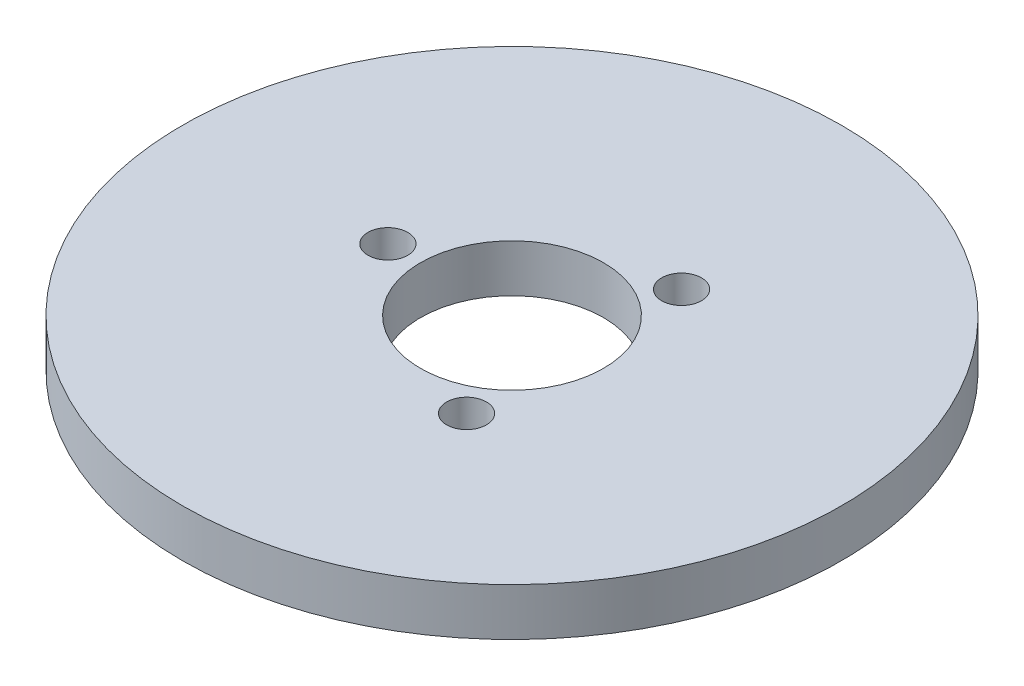
ISO-10303-21;
HEADER;
FILE_DESCRIPTION(('STEP AP214'),'2;1');
FILE_NAME('part.step','',(''),(''),'','','');
FILE_SCHEMA(('AUTOMOTIVE_DESIGN { 1 0 10303 214 1 1 1 1 }'));
ENDSEC;
DATA;
#1=APPLICATION_CONTEXT('core data for automotive mechanical design processes');
#2=APPLICATION_PROTOCOL_DEFINITION('international standard','automotive_design',2000,#1);
#3=PRODUCT_CONTEXT('',#1,'mechanical');
#4=PRODUCT('Part','Part','',(#3));
#5=PRODUCT_RELATED_PRODUCT_CATEGORY('part','',(#4));
#6=PRODUCT_DEFINITION_FORMATION('','',#4);
#7=PRODUCT_DEFINITION_CONTEXT('part definition',#1,'design');
#8=PRODUCT_DEFINITION('design','',#6,#7);
#9=PRODUCT_DEFINITION_SHAPE('','',#8);
#10=(LENGTH_UNIT() NAMED_UNIT(*) SI_UNIT(.MILLI.,.METRE.));
#11=(NAMED_UNIT(*) PLANE_ANGLE_UNIT() SI_UNIT($,.RADIAN.));
#12=(NAMED_UNIT(*) SI_UNIT($,.STERADIAN.) SOLID_ANGLE_UNIT());
#13=UNCERTAINTY_MEASURE_WITH_UNIT(LENGTH_MEASURE(1.E-05),#10,'distance_accuracy_value','');
#14=(GEOMETRIC_REPRESENTATION_CONTEXT(3) GLOBAL_UNCERTAINTY_ASSIGNED_CONTEXT((#13)) GLOBAL_UNIT_ASSIGNED_CONTEXT((#10,
#11,#12)) REPRESENTATION_CONTEXT('',''));
#15=CARTESIAN_POINT('',(0.,0.,0.));
#16=DIRECTION('',(0.,0.,1.));
#17=DIRECTION('',(1.,0.,0.));
#18=AXIS2_PLACEMENT_3D('',#15,#16,#17);
#19=CARTESIAN_POINT('',(0.,13.,0.));
#20=DIRECTION('',(0.,-1.,0.));
#21=DIRECTION('',(0.,0.,-1.));
#22=AXIS2_PLACEMENT_3D('',#19,#20,#21);
#23=CYLINDRICAL_SURFACE('',#22,90.);
#24=CARTESIAN_POINT('',(0.,13.,0.));
#25=DIRECTION('',(0.,1.,0.));
#26=DIRECTION('',(0.,0.,1.));
#27=AXIS2_PLACEMENT_3D('',#24,#25,#26);
#28=CIRCLE('',#27,90.);
#29=CARTESIAN_POINT('',(0.,13.,-90.));
#30=VERTEX_POINT('',#29);
#31=EDGE_CURVE('E10',#30,#30,#28,.T.);
#32=CARTESIAN_POINT('',(0.,0.,0.));
#33=DIRECTION('',(0.,1.,0.));
#34=DIRECTION('',(0.,0.,1.));
#35=AXIS2_PLACEMENT_3D('',#32,#33,#34);
#36=CIRCLE('',#35,90.);
#37=CARTESIAN_POINT('',(0.,0.,-90.));
#38=VERTEX_POINT('',#37);
#39=EDGE_CURVE('E37',#38,#38,#36,.T.);
#40=CARTESIAN_POINT('',(0.,13.,-90.));
#41=CARTESIAN_POINT('',(0.,12.8645833333333,-90.));
#42=CARTESIAN_POINT('',(0.,12.7291666666667,-90.));
#43=CARTESIAN_POINT('',(0.,12.4583333333333,-90.));
#44=CARTESIAN_POINT('',(0.,12.3229166666667,-90.));
#45=CARTESIAN_POINT('',(0.,12.0520833333333,-90.));
#46=CARTESIAN_POINT('',(0.,11.9166666666667,-90.));
#47=CARTESIAN_POINT('',(0.,11.6458333333333,-90.));
#48=CARTESIAN_POINT('',(0.,11.5104166666667,-90.));
#49=CARTESIAN_POINT('',(0.,11.2395833333333,-90.));
#50=CARTESIAN_POINT('',(0.,11.1041666666667,-90.));
#51=CARTESIAN_POINT('',(0.,10.8333333333333,-90.));
#52=CARTESIAN_POINT('',(0.,10.6979166666667,-90.));
#53=CARTESIAN_POINT('',(0.,10.4270833333333,-90.));
#54=CARTESIAN_POINT('',(0.,10.2916666666667,-90.));
#55=CARTESIAN_POINT('',(0.,10.0208333333333,-90.));
#56=CARTESIAN_POINT('',(0.,9.88541666666667,-90.));
#57=CARTESIAN_POINT('',(0.,9.61458333333333,-90.));
#58=CARTESIAN_POINT('',(0.,9.47916666666667,-90.));
#59=CARTESIAN_POINT('',(0.,9.20833333333333,-90.));
#60=CARTESIAN_POINT('',(0.,9.07291666666666,-90.));
#61=CARTESIAN_POINT('',(0.,8.80208333333333,-90.));
#62=CARTESIAN_POINT('',(0.,8.66666666666667,-90.));
#63=CARTESIAN_POINT('',(0.,8.39583333333333,-90.));
#64=CARTESIAN_POINT('',(0.,8.26041666666667,-90.));
#65=CARTESIAN_POINT('',(0.,7.98958333333333,-90.));
#66=CARTESIAN_POINT('',(0.,7.85416666666667,-90.));
#67=CARTESIAN_POINT('',(0.,7.58333333333333,-90.));
#68=CARTESIAN_POINT('',(0.,7.44791666666667,-90.));
#69=CARTESIAN_POINT('',(0.,7.17708333333333,-90.));
#70=CARTESIAN_POINT('',(0.,7.04166666666667,-90.));
#71=CARTESIAN_POINT('',(0.,6.77083333333333,-90.));
#72=CARTESIAN_POINT('',(0.,6.63541666666667,-90.));
#73=CARTESIAN_POINT('',(0.,6.36458333333333,-90.));
#74=CARTESIAN_POINT('',(0.,6.22916666666667,-90.));
#75=CARTESIAN_POINT('',(0.,5.95833333333333,-90.));
#76=CARTESIAN_POINT('',(0.,5.82291666666667,-90.));
#77=CARTESIAN_POINT('',(0.,5.55208333333333,-90.));
#78=CARTESIAN_POINT('',(0.,5.41666666666667,-90.));
#79=CARTESIAN_POINT('',(0.,5.14583333333333,-90.));
#80=CARTESIAN_POINT('',(0.,5.01041666666667,-90.));
#81=CARTESIAN_POINT('',(0.,4.73958333333333,-90.));
#82=CARTESIAN_POINT('',(0.,4.60416666666667,-90.));
#83=CARTESIAN_POINT('',(0.,4.33333333333333,-90.));
#84=CARTESIAN_POINT('',(0.,4.19791666666667,-90.));
#85=CARTESIAN_POINT('',(0.,3.92708333333333,-90.));
#86=CARTESIAN_POINT('',(0.,3.79166666666667,-90.));
#87=CARTESIAN_POINT('',(0.,3.52083333333333,-90.));
#88=CARTESIAN_POINT('',(0.,3.38541666666667,-90.));
#89=CARTESIAN_POINT('',(0.,3.11458333333333,-90.));
#90=CARTESIAN_POINT('',(0.,2.97916666666667,-90.));
#91=CARTESIAN_POINT('',(0.,2.70833333333333,-90.));
#92=CARTESIAN_POINT('',(0.,2.57291666666667,-90.));
#93=CARTESIAN_POINT('',(0.,2.30208333333333,-90.));
#94=CARTESIAN_POINT('',(0.,2.16666666666667,-90.));
#95=CARTESIAN_POINT('',(0.,1.89583333333333,-90.));
#96=CARTESIAN_POINT('',(0.,1.76041666666667,-90.));
#97=CARTESIAN_POINT('',(0.,1.48958333333333,-90.));
#98=CARTESIAN_POINT('',(0.,1.35416666666667,-90.));
#99=CARTESIAN_POINT('',(0.,1.08333333333333,-90.));
#100=CARTESIAN_POINT('',(0.,0.947916666666667,-90.));
#101=CARTESIAN_POINT('',(0.,0.677083333333334,-90.));
#102=CARTESIAN_POINT('',(0.,0.541666666666667,-90.));
#103=CARTESIAN_POINT('',(0.,0.270833333333334,-90.));
#104=CARTESIAN_POINT('',(0.,0.135416666666667,-90.));
#105=CARTESIAN_POINT('',(0.,0.,-90.));
#106=B_SPLINE_CURVE_WITH_KNOTS('',3,(#40,#41,#42,#43,#44,#45,#46,#47,#48,#49,#50,#51,#52,#53,
#54,#55,#56,#57,#58,#59,#60,#61,#62,#63,#64,#65,#66,#67,#68,#69,#70,#71,#72,#73,#74,#75,#76,#77,
#78,#79,#80,#81,#82,#83,#84,#85,#86,#87,#88,#89,#90,#91,#92,#93,#94,#95,#96,#97,#98,#99,#100,
#101,#102,#103,#104,#105),.UNSPECIFIED.,.F.,.F.,(4,2,2,2,2,2,2,2,2,2,2,2,2,2,2,2,2,2,2,2,2,2,2,
2,2,2,2,2,2,2,2,2,4),(0.,0.40625,0.812500000000001,1.21875,1.625,2.03125,2.4375,2.84375,3.25,
3.65625,4.0625,4.46875,4.875,5.28125,5.6875,6.09375,6.5,6.90625,7.3125,7.71875,8.125,8.53125,
8.9375,9.34375,9.75,10.15625,10.5625,10.96875,11.375,11.78125,12.1875,12.59375,13.),.UNSPECIFIED.);
#107=EDGE_CURVE('BSEAM40',#30,#38,#106,.T.);
#108=ORIENTED_EDGE('',*,*,#31,.F.);
#109=ORIENTED_EDGE('',*,*,#39,.T.);
#110=ORIENTED_EDGE('',*,*,#107,.T.);
#111=ORIENTED_EDGE('',*,*,#107,.F.);
#112=EDGE_LOOP('',(#108,#110,#109,#111));
#113=FACE_BOUND('',#112,.T.);
#114=ADVANCED_FACE('F40',(#113),#23,.T.);
#115=CARTESIAN_POINT('',(0.,13.,0.));
#116=DIRECTION('',(0.,1.,0.));
#117=DIRECTION('',(0.,0.,1.));
#118=AXIS2_PLACEMENT_3D('',#115,#116,#117);
#119=PLANE('',#118);
#120=CARTESIAN_POINT('',(16.9483869064172,13.,29.3554672282495));
#121=DIRECTION('',(0.,1.,0.));
#122=DIRECTION('',(0.866025403784436,0.,-0.500000000000004));
#123=AXIS2_PLACEMENT_3D('',#120,#121,#122);
#124=CIRCLE('',#123,5.43421232233891);
#125=CARTESIAN_POINT('',(21.6545528271212,13.,26.63836106708));
#126=VERTEX_POINT('',#125);
#127=EDGE_CURVE('E70',#126,#126,#124,.T.);
#128=ORIENTED_EDGE('',*,*,#127,.F.);
#129=EDGE_LOOP('',(#128));
#130=FACE_BOUND('',#129,.T.);
#131=CARTESIAN_POINT('',(16.9483869064168,13.,-29.3554672282497));
#132=DIRECTION('',(0.,1.,0.));
#133=DIRECTION('',(-0.866025403784443,0.,-0.499999999999992));
#134=AXIS2_PLACEMENT_3D('',#131,#132,#133);
#135=CIRCLE('',#134,5.43421232233891);
#136=CARTESIAN_POINT('',(12.2422209857129,13.,-32.0725733894191));
#137=VERTEX_POINT('',#136);
#138=EDGE_CURVE('E61',#137,#137,#135,.T.);
#139=ORIENTED_EDGE('',*,*,#138,.F.);
#140=EDGE_LOOP('',(#139));
#141=FACE_BOUND('',#140,.T.);
#142=CARTESIAN_POINT('',(-33.8967738128342,13.,0.));
#143=DIRECTION('',(0.,1.,0.));
#144=DIRECTION('',(0.,0.,1.));
#145=AXIS2_PLACEMENT_3D('',#142,#143,#144);
#146=CIRCLE('',#145,5.43421232233891);
#147=CARTESIAN_POINT('',(-33.8967738128342,13.,5.43421232233891));
#148=VERTEX_POINT('',#147);
#149=EDGE_CURVE('E54',#148,#148,#146,.T.);
#150=ORIENTED_EDGE('',*,*,#149,.F.);
#151=EDGE_LOOP('',(#150));
#152=FACE_BOUND('',#151,.T.);
#153=CARTESIAN_POINT('',(0.,13.,0.));
#154=DIRECTION('',(0.,1.,0.));
#155=DIRECTION('',(0.,0.,1.));
#156=AXIS2_PLACEMENT_3D('',#153,#154,#155);
#157=CIRCLE('',#156,25.);
#158=CARTESIAN_POINT('',(0.,13.,-25.));
#159=VERTEX_POINT('',#158);
#160=EDGE_CURVE('E50',#159,#159,#157,.T.);
#161=ORIENTED_EDGE('',*,*,#160,.F.);
#162=EDGE_LOOP('',(#161));
#163=FACE_BOUND('',#162,.T.);
#164=ORIENTED_EDGE('',*,*,#31,.T.);
#165=EDGE_LOOP('',(#164));
#166=FACE_BOUND('',#165,.T.);
#167=ADVANCED_FACE('F85',(#130,#141,#152,#163,#166),#119,.T.);
#168=CARTESIAN_POINT('',(0.,0.,0.));
#169=DIRECTION('',(0.,1.,0.));
#170=DIRECTION('',(0.,0.,1.));
#171=AXIS2_PLACEMENT_3D('',#168,#169,#170);
#172=PLANE('',#171);
#173=CARTESIAN_POINT('',(0.,0.,0.));
#174=DIRECTION('',(0.,1.,0.));
#175=DIRECTION('',(0.,0.,1.));
#176=AXIS2_PLACEMENT_3D('',#173,#174,#175);
#177=CIRCLE('',#176,25.);
#178=CARTESIAN_POINT('',(0.,0.,-25.));
#179=VERTEX_POINT('',#178);
#180=EDGE_CURVE('E47',#179,#179,#177,.T.);
#181=ORIENTED_EDGE('',*,*,#180,.T.);
#182=EDGE_LOOP('',(#181));
#183=FACE_BOUND('',#182,.T.);
#184=ORIENTED_EDGE('',*,*,#39,.F.);
#185=EDGE_LOOP('',(#184));
#186=FACE_BOUND('',#185,.T.);
#187=ADVANCED_FACE('F84',(#183,#186),#172,.F.);
#188=CARTESIAN_POINT('',(0.,13.,0.));
#189=DIRECTION('',(0.,-1.,0.));
#190=DIRECTION('',(0.,0.,-1.));
#191=AXIS2_PLACEMENT_3D('',#188,#189,#190);
#192=CYLINDRICAL_SURFACE('',#191,25.);
#193=CARTESIAN_POINT('',(0.,13.,-25.));
#194=CARTESIAN_POINT('',(0.,12.8645833333333,-25.));
#195=CARTESIAN_POINT('',(0.,12.7291666666667,-25.));
#196=CARTESIAN_POINT('',(0.,12.4583333333333,-25.));
#197=CARTESIAN_POINT('',(0.,12.3229166666667,-25.));
#198=CARTESIAN_POINT('',(0.,12.0520833333333,-25.));
#199=CARTESIAN_POINT('',(0.,11.9166666666667,-25.));
#200=CARTESIAN_POINT('',(0.,11.6458333333333,-25.));
#201=CARTESIAN_POINT('',(0.,11.5104166666667,-25.));
#202=CARTESIAN_POINT('',(0.,11.2395833333333,-25.));
#203=CARTESIAN_POINT('',(0.,11.1041666666667,-25.));
#204=CARTESIAN_POINT('',(0.,10.8333333333333,-25.));
#205=CARTESIAN_POINT('',(0.,10.6979166666667,-25.));
#206=CARTESIAN_POINT('',(0.,10.4270833333333,-25.));
#207=CARTESIAN_POINT('',(0.,10.2916666666667,-25.));
#208=CARTESIAN_POINT('',(0.,10.0208333333333,-25.));
#209=CARTESIAN_POINT('',(0.,9.88541666666667,-25.));
#210=CARTESIAN_POINT('',(0.,9.61458333333333,-25.));
#211=CARTESIAN_POINT('',(0.,9.47916666666667,-25.));
#212=CARTESIAN_POINT('',(0.,9.20833333333333,-25.));
#213=CARTESIAN_POINT('',(0.,9.07291666666667,-25.));
#214=CARTESIAN_POINT('',(0.,8.80208333333333,-25.));
#215=CARTESIAN_POINT('',(0.,8.66666666666667,-25.));
#216=CARTESIAN_POINT('',(0.,8.39583333333333,-25.));
#217=CARTESIAN_POINT('',(0.,8.26041666666667,-25.));
#218=CARTESIAN_POINT('',(0.,7.98958333333333,-25.));
#219=CARTESIAN_POINT('',(0.,7.85416666666667,-25.));
#220=CARTESIAN_POINT('',(0.,7.58333333333333,-25.));
#221=CARTESIAN_POINT('',(0.,7.44791666666667,-25.));
#222=CARTESIAN_POINT('',(0.,7.17708333333333,-25.));
#223=CARTESIAN_POINT('',(0.,7.04166666666667,-25.));
#224=CARTESIAN_POINT('',(0.,6.77083333333333,-25.));
#225=CARTESIAN_POINT('',(0.,6.63541666666667,-25.));
#226=CARTESIAN_POINT('',(0.,6.36458333333333,-25.));
#227=CARTESIAN_POINT('',(0.,6.22916666666667,-25.));
#228=CARTESIAN_POINT('',(0.,5.95833333333333,-25.));
#229=CARTESIAN_POINT('',(0.,5.82291666666667,-25.));
#230=CARTESIAN_POINT('',(0.,5.55208333333333,-25.));
#231=CARTESIAN_POINT('',(0.,5.41666666666667,-25.));
#232=CARTESIAN_POINT('',(0.,5.14583333333333,-25.));
#233=CARTESIAN_POINT('',(0.,5.01041666666667,-25.));
#234=CARTESIAN_POINT('',(0.,4.73958333333333,-25.));
#235=CARTESIAN_POINT('',(0.,4.60416666666667,-25.));
#236=CARTESIAN_POINT('',(0.,4.33333333333333,-25.));
#237=CARTESIAN_POINT('',(0.,4.19791666666667,-25.));
#238=CARTESIAN_POINT('',(0.,3.92708333333333,-25.));
#239=CARTESIAN_POINT('',(0.,3.79166666666667,-25.));
#240=CARTESIAN_POINT('',(0.,3.52083333333333,-25.));
#241=CARTESIAN_POINT('',(0.,3.38541666666667,-25.));
#242=CARTESIAN_POINT('',(0.,3.11458333333333,-25.));
#243=CARTESIAN_POINT('',(0.,2.97916666666667,-25.));
#244=CARTESIAN_POINT('',(0.,2.70833333333333,-25.));
#245=CARTESIAN_POINT('',(0.,2.57291666666667,-25.));
#246=CARTESIAN_POINT('',(0.,2.30208333333333,-25.));
#247=CARTESIAN_POINT('',(0.,2.16666666666667,-25.));
#248=CARTESIAN_POINT('',(0.,1.89583333333333,-25.));
#249=CARTESIAN_POINT('',(0.,1.76041666666667,-25.));
#250=CARTESIAN_POINT('',(0.,1.48958333333333,-25.));
#251=CARTESIAN_POINT('',(0.,1.35416666666667,-25.));
#252=CARTESIAN_POINT('',(0.,1.08333333333333,-25.));
#253=CARTESIAN_POINT('',(0.,0.947916666666667,-25.));
#254=CARTESIAN_POINT('',(0.,0.677083333333334,-25.));
#255=CARTESIAN_POINT('',(0.,0.541666666666667,-25.));
#256=CARTESIAN_POINT('',(0.,0.270833333333334,-25.));
#257=CARTESIAN_POINT('',(0.,0.135416666666667,-25.));
#258=CARTESIAN_POINT('',(0.,0.,-25.));
#259=B_SPLINE_CURVE_WITH_KNOTS('',3,(#193,#194,#195,#196,#197,#198,#199,#200,#201,#202,#203,
#204,#205,#206,#207,#208,#209,#210,#211,#212,#213,#214,#215,#216,#217,#218,#219,#220,#221,#222,
#223,#224,#225,#226,#227,#228,#229,#230,#231,#232,#233,#234,#235,#236,#237,#238,#239,#240,#241,
#242,#243,#244,#245,#246,#247,#248,#249,#250,#251,#252,#253,#254,#255,#256,#257,#258),
.UNSPECIFIED.,.F.,.F.,(4,2,2,2,2,2,2,2,2,2,2,2,2,2,2,2,2,2,2,2,2,2,2,2,2,2,2,2,2,2,2,2,4),(0.,
0.406249999999999,0.812499999999999,1.21875,1.625,2.03125,2.4375,2.84375,3.25,3.65625,4.0625,
4.46875,4.875,5.28125,5.6875,6.09375,6.5,6.90625,7.3125,7.71875,8.125,8.53125,8.9375,9.34375,
9.75,10.15625,10.5625,10.96875,11.375,11.78125,12.1875,12.59375,13.),.UNSPECIFIED.);
#260=EDGE_CURVE('BSEAM91',#159,#179,#259,.T.);
#261=ORIENTED_EDGE('',*,*,#160,.T.);
#262=ORIENTED_EDGE('',*,*,#180,.F.);
#263=ORIENTED_EDGE('',*,*,#260,.T.);
#264=ORIENTED_EDGE('',*,*,#260,.F.);
#265=EDGE_LOOP('',(#261,#263,#262,#264));
#266=FACE_BOUND('',#265,.T.);
#267=ADVANCED_FACE('F91',(#266),#192,.F.);
#268=CARTESIAN_POINT('',(-33.8967738128342,1.03254653160797,0.));
#269=DIRECTION('',(0.,1.,0.));
#270=DIRECTION('',(0.,0.,1.));
#271=AXIS2_PLACEMENT_3D('',#268,#269,#270);
#272=CYLINDRICAL_SURFACE('',#271,5.43421232233891);
#273=CARTESIAN_POINT('',(-33.8967738128342,1.03254653160797,0.));
#274=DIRECTION('',(0.,1.,0.));
#275=DIRECTION('',(0.,0.,1.));
#276=AXIS2_PLACEMENT_3D('',#273,#274,#275);
#277=CIRCLE('',#276,5.43421232233891);
#278=CARTESIAN_POINT('',(-33.8967738128342,1.03254653160797,5.43421232233891));
#279=VERTEX_POINT('',#278);
#280=EDGE_CURVE('E55',#279,#279,#277,.T.);
#281=ORIENTED_EDGE('',*,*,#280,.F.);
#282=EDGE_LOOP('',(#281));
#283=FACE_BOUND('',#282,.T.);
#284=ORIENTED_EDGE('',*,*,#149,.T.);
#285=EDGE_LOOP('',(#284));
#286=FACE_BOUND('',#285,.T.);
#287=ADVANCED_FACE('F96',(#283,#286),#272,.F.);
#288=CARTESIAN_POINT('',(-33.8967738128342,1.03254653160797,0.));
#289=DIRECTION('',(0.,1.,0.));
#290=DIRECTION('',(0.,0.,1.));
#291=AXIS2_PLACEMENT_3D('',#288,#289,#290);
#292=PLANE('',#291);
#293=ORIENTED_EDGE('',*,*,#280,.T.);
#294=EDGE_LOOP('',(#293));
#295=FACE_BOUND('',#294,.T.);
#296=ADVANCED_FACE('F127',(#295),#292,.T.);
#297=CARTESIAN_POINT('',(16.9483869064168,1.03254653160797,-29.3554672282497));
#298=DIRECTION('',(0.,1.,0.));
#299=DIRECTION('',(0.,0.,1.));
#300=AXIS2_PLACEMENT_3D('',#297,#298,#299);
#301=CYLINDRICAL_SURFACE('',#300,5.43421232233891);
#302=CARTESIAN_POINT('',(16.9483869064168,1.03254653160797,-29.3554672282497));
#303=DIRECTION('',(0.,1.,0.));
#304=DIRECTION('',(-0.866025403784443,0.,-0.499999999999992));
#305=AXIS2_PLACEMENT_3D('',#302,#303,#304);
#306=CIRCLE('',#305,5.43421232233891);
#307=CARTESIAN_POINT('',(12.2422209857129,1.03254653160797,-32.0725733894191));
#308=VERTEX_POINT('',#307);
#309=EDGE_CURVE('E63',#308,#308,#306,.T.);
#310=ORIENTED_EDGE('',*,*,#309,.F.);
#311=EDGE_LOOP('',(#310));
#312=FACE_BOUND('',#311,.T.);
#313=ORIENTED_EDGE('',*,*,#138,.T.);
#314=EDGE_LOOP('',(#313));
#315=FACE_BOUND('',#314,.T.);
#316=ADVANCED_FACE('F133',(#312,#315),#301,.F.);
#317=CARTESIAN_POINT('',(16.9483869064168,1.03254653160797,-29.3554672282497));
#318=DIRECTION('',(0.,1.,0.));
#319=DIRECTION('',(-0.866025403784443,0.,-0.499999999999992));
#320=AXIS2_PLACEMENT_3D('',#317,#318,#319);
#321=PLANE('',#320);
#322=ORIENTED_EDGE('',*,*,#309,.T.);
#323=EDGE_LOOP('',(#322));
#324=FACE_BOUND('',#323,.T.);
#325=ADVANCED_FACE('F77',(#324),#321,.T.);
#326=CARTESIAN_POINT('',(16.9483869064172,1.03254653160797,29.3554672282495));
#327=DIRECTION('',(0.,1.,0.));
#328=DIRECTION('',(0.,0.,1.));
#329=AXIS2_PLACEMENT_3D('',#326,#327,#328);
#330=CYLINDRICAL_SURFACE('',#329,5.43421232233891);
#331=CARTESIAN_POINT('',(16.9483869064172,1.03254653160797,29.3554672282495));
#332=DIRECTION('',(0.,1.,0.));
#333=DIRECTION('',(0.866025403784436,0.,-0.500000000000004));
#334=AXIS2_PLACEMENT_3D('',#331,#332,#333);
#335=CIRCLE('',#334,5.43421232233891);
#336=CARTESIAN_POINT('',(21.6545528271212,1.03254653160797,26.63836106708));
#337=VERTEX_POINT('',#336);
#338=EDGE_CURVE('E59',#337,#337,#335,.T.);
#339=ORIENTED_EDGE('',*,*,#338,.F.);
#340=EDGE_LOOP('',(#339));
#341=FACE_BOUND('',#340,.T.);
#342=ORIENTED_EDGE('',*,*,#127,.T.);
#343=EDGE_LOOP('',(#342));
#344=FACE_BOUND('',#343,.T.);
#345=ADVANCED_FACE('F73',(#341,#344),#330,.F.);
#346=CARTESIAN_POINT('',(16.9483869064172,1.03254653160797,29.3554672282495));
#347=DIRECTION('',(0.,1.,0.));
#348=DIRECTION('',(0.866025403784436,0.,-0.500000000000004));
#349=AXIS2_PLACEMENT_3D('',#346,#347,#348);
#350=PLANE('',#349);
#351=ORIENTED_EDGE('',*,*,#338,.T.);
#352=EDGE_LOOP('',(#351));
#353=FACE_BOUND('',#352,.T.);
#354=ADVANCED_FACE('F71',(#353),#350,.T.);
#355=CLOSED_SHELL('',(#114,#167,#187,#267,#287,#296,#316,#325,#345,#354));
#356=MANIFOLD_SOLID_BREP('B2',#355);
#357=ADVANCED_BREP_SHAPE_REPRESENTATION('',(#18,#356),#14);
#358=SHAPE_DEFINITION_REPRESENTATION(#9,#357);
ENDSEC;
END-ISO-10303-21;
